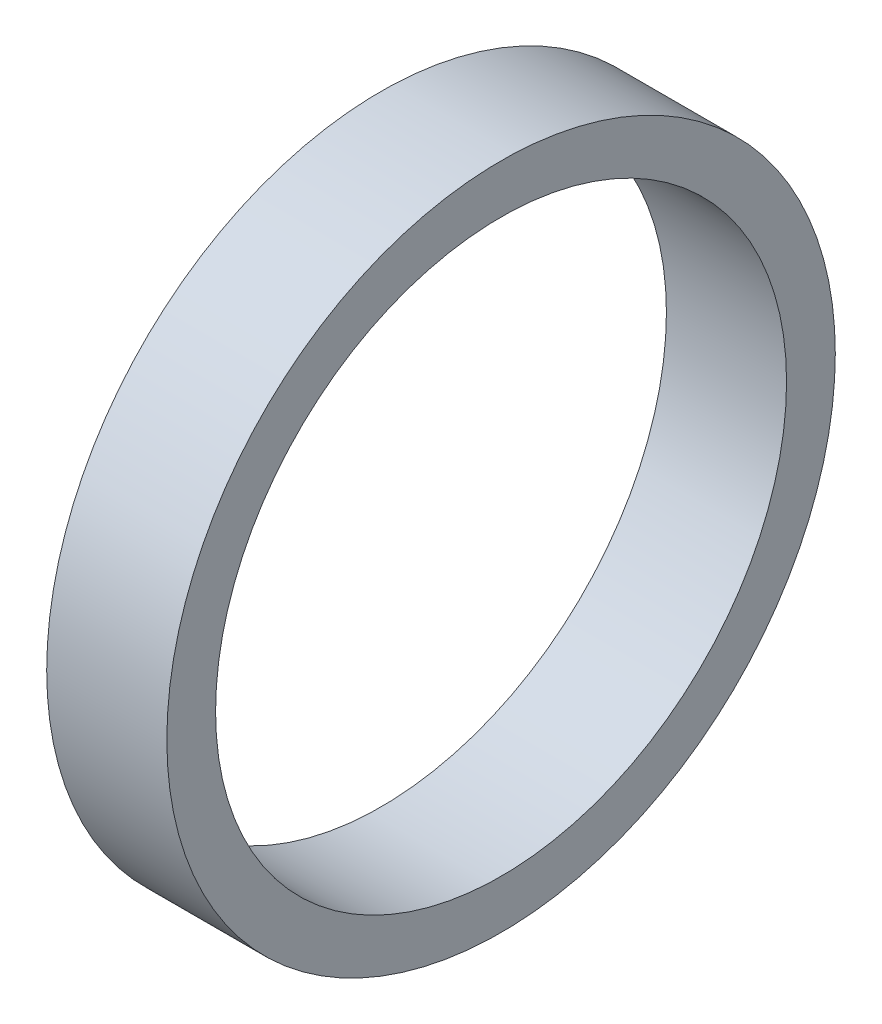
ISO-10303-21;
HEADER;
FILE_DESCRIPTION(('STEP AP214'),'2;1');
FILE_NAME('part.step','',(''),(''),'','','');
FILE_SCHEMA(('AUTOMOTIVE_DESIGN { 1 0 10303 214 1 1 1 1 }'));
ENDSEC;
DATA;
#1=APPLICATION_CONTEXT('core data for automotive mechanical design processes');
#2=APPLICATION_PROTOCOL_DEFINITION('international standard','automotive_design',2000,#1);
#3=PRODUCT_CONTEXT('',#1,'mechanical');
#4=PRODUCT('Part','Part','',(#3));
#5=PRODUCT_RELATED_PRODUCT_CATEGORY('part','',(#4));
#6=PRODUCT_DEFINITION_FORMATION('','',#4);
#7=PRODUCT_DEFINITION_CONTEXT('part definition',#1,'design');
#8=PRODUCT_DEFINITION('design','',#6,#7);
#9=PRODUCT_DEFINITION_SHAPE('','',#8);
#10=(LENGTH_UNIT() NAMED_UNIT(*) SI_UNIT(.MILLI.,.METRE.));
#11=(NAMED_UNIT(*) PLANE_ANGLE_UNIT() SI_UNIT($,.RADIAN.));
#12=(NAMED_UNIT(*) SI_UNIT($,.STERADIAN.) SOLID_ANGLE_UNIT());
#13=UNCERTAINTY_MEASURE_WITH_UNIT(LENGTH_MEASURE(1.E-05),#10,'distance_accuracy_value','');
#14=(GEOMETRIC_REPRESENTATION_CONTEXT(3) GLOBAL_UNCERTAINTY_ASSIGNED_CONTEXT((#13)) GLOBAL_UNIT_ASSIGNED_CONTEXT((#10,
#11,#12)) REPRESENTATION_CONTEXT('',''));
#15=CARTESIAN_POINT('',(0.,0.,0.));
#16=DIRECTION('',(0.,0.,1.));
#17=DIRECTION('',(1.,0.,0.));
#18=AXIS2_PLACEMENT_3D('',#15,#16,#17);
#19=CARTESIAN_POINT('',(6.47,0.,0.));
#20=DIRECTION('',(1.,0.,0.));
#21=DIRECTION('',(0.,0.,-1.));
#22=AXIS2_PLACEMENT_3D('',#19,#20,#21);
#23=PLANE('',#22);
#24=CARTESIAN_POINT('',(6.47,0.,0.));
#25=DIRECTION('',(1.,0.,0.));
#26=DIRECTION('',(0.,0.,-1.));
#27=AXIS2_PLACEMENT_3D('',#24,#25,#26);
#28=CIRCLE('',#27,18.);
#29=CARTESIAN_POINT('',(6.47,0.,-18.));
#30=VERTEX_POINT('',#29);
#31=EDGE_CURVE('E10',#30,#30,#28,.T.);
#32=ORIENTED_EDGE('',*,*,#31,.T.);
#33=EDGE_LOOP('',(#32));
#34=FACE_BOUND('',#33,.T.);
#35=CARTESIAN_POINT('',(6.47,0.,0.));
#36=DIRECTION('',(1.,0.,0.));
#37=DIRECTION('',(0.,0.,-1.));
#38=AXIS2_PLACEMENT_3D('',#35,#36,#37);
#39=CIRCLE('',#38,15.375);
#40=CARTESIAN_POINT('',(6.47,0.,-15.375));
#41=VERTEX_POINT('',#40);
#42=EDGE_CURVE('E42',#41,#41,#39,.T.);
#43=ORIENTED_EDGE('',*,*,#42,.F.);
#44=EDGE_LOOP('',(#43));
#45=FACE_BOUND('',#44,.T.);
#46=ADVANCED_FACE('F31',(#34,#45),#23,.T.);
#47=CARTESIAN_POINT('',(0.,0.,0.));
#48=DIRECTION('',(1.,0.,0.));
#49=DIRECTION('',(0.,0.,-1.));
#50=AXIS2_PLACEMENT_3D('',#47,#48,#49);
#51=PLANE('',#50);
#52=CARTESIAN_POINT('',(0.,0.,0.));
#53=DIRECTION('',(1.,0.,0.));
#54=DIRECTION('',(0.,0.,-1.));
#55=AXIS2_PLACEMENT_3D('',#52,#53,#54);
#56=CIRCLE('',#55,18.);
#57=CARTESIAN_POINT('',(0.,0.,-18.));
#58=VERTEX_POINT('',#57);
#59=EDGE_CURVE('E35',#58,#58,#56,.T.);
#60=ORIENTED_EDGE('',*,*,#59,.F.);
#61=EDGE_LOOP('',(#60));
#62=FACE_BOUND('',#61,.T.);
#63=CARTESIAN_POINT('',(0.,0.,0.));
#64=DIRECTION('',(1.,0.,0.));
#65=DIRECTION('',(0.,0.,-1.));
#66=AXIS2_PLACEMENT_3D('',#63,#64,#65);
#67=CIRCLE('',#66,15.375);
#68=CARTESIAN_POINT('',(0.,0.,-15.375));
#69=VERTEX_POINT('',#68);
#70=EDGE_CURVE('E44',#69,#69,#67,.T.);
#71=ORIENTED_EDGE('',*,*,#70,.T.);
#72=EDGE_LOOP('',(#71));
#73=FACE_BOUND('',#72,.T.);
#74=ADVANCED_FACE('F54',(#62,#73),#51,.F.);
#75=CARTESIAN_POINT('',(6.47,0.,0.));
#76=DIRECTION('',(-1.,0.,0.));
#77=DIRECTION('',(0.,0.,1.));
#78=AXIS2_PLACEMENT_3D('',#75,#76,#77);
#79=CYLINDRICAL_SURFACE('',#78,18.);
#80=ORIENTED_EDGE('',*,*,#31,.F.);
#81=EDGE_LOOP('',(#80));
#82=FACE_BOUND('',#81,.T.);
#83=ORIENTED_EDGE('',*,*,#59,.T.);
#84=EDGE_LOOP('',(#83));
#85=FACE_BOUND('',#84,.T.);
#86=ADVANCED_FACE('F33',(#82,#85),#79,.T.);
#87=CARTESIAN_POINT('',(6.47,0.,0.));
#88=DIRECTION('',(-1.,0.,0.));
#89=DIRECTION('',(0.,0.,1.));
#90=AXIS2_PLACEMENT_3D('',#87,#88,#89);
#91=CYLINDRICAL_SURFACE('',#90,15.375);
#92=ORIENTED_EDGE('',*,*,#42,.T.);
#93=EDGE_LOOP('',(#92));
#94=FACE_BOUND('',#93,.T.);
#95=ORIENTED_EDGE('',*,*,#70,.F.);
#96=EDGE_LOOP('',(#95));
#97=FACE_BOUND('',#96,.T.);
#98=ADVANCED_FACE('F50',(#94,#97),#91,.F.);
#99=CLOSED_SHELL('',(#46,#74,#86,#98));
#100=MANIFOLD_SOLID_BREP('B2',#99);
#101=ADVANCED_BREP_SHAPE_REPRESENTATION('',(#18,#100),#14);
#102=SHAPE_DEFINITION_REPRESENTATION(#9,#101);
ENDSEC;
END-ISO-10303-21;
